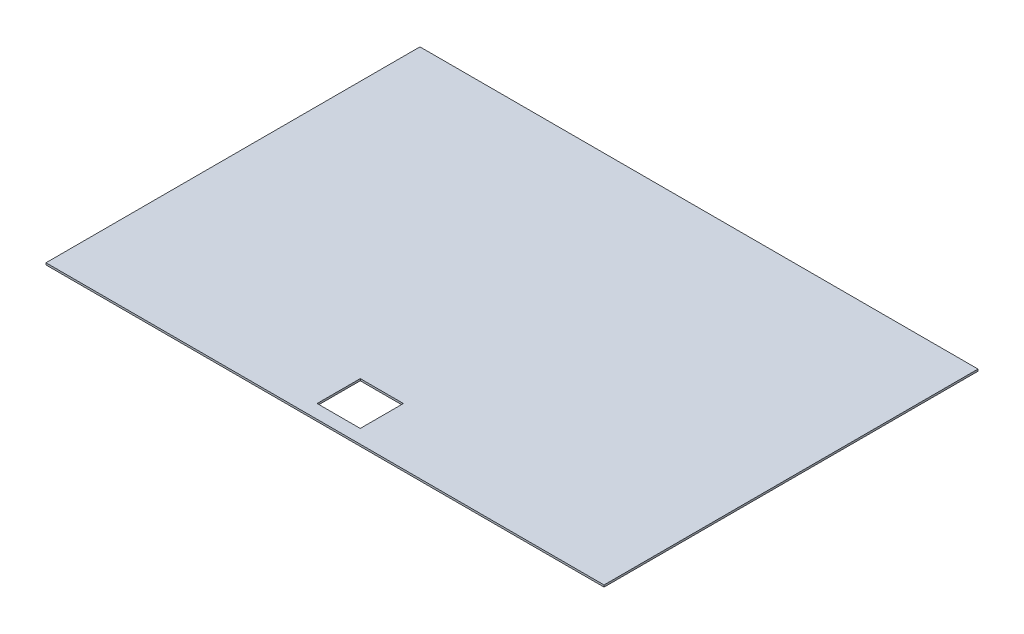
ISO-10303-21;
HEADER;
FILE_DESCRIPTION(('STEP AP214'),'2;1');
FILE_NAME('part.step','',(''),(''),'','','');
FILE_SCHEMA(('AUTOMOTIVE_DESIGN { 1 0 10303 214 1 1 1 1 }'));
ENDSEC;
DATA;
#1=APPLICATION_CONTEXT('core data for automotive mechanical design processes');
#2=APPLICATION_PROTOCOL_DEFINITION('international standard','automotive_design',2000,#1);
#3=PRODUCT_CONTEXT('',#1,'mechanical');
#4=PRODUCT('Part','Part','',(#3));
#5=PRODUCT_RELATED_PRODUCT_CATEGORY('part','',(#4));
#6=PRODUCT_DEFINITION_FORMATION('','',#4);
#7=PRODUCT_DEFINITION_CONTEXT('part definition',#1,'design');
#8=PRODUCT_DEFINITION('design','',#6,#7);
#9=PRODUCT_DEFINITION_SHAPE('','',#8);
#10=(LENGTH_UNIT() NAMED_UNIT(*) SI_UNIT(.MILLI.,.METRE.));
#11=(NAMED_UNIT(*) PLANE_ANGLE_UNIT() SI_UNIT($,.RADIAN.));
#12=(NAMED_UNIT(*) SI_UNIT($,.STERADIAN.) SOLID_ANGLE_UNIT());
#13=UNCERTAINTY_MEASURE_WITH_UNIT(LENGTH_MEASURE(1.E-05),#10,'distance_accuracy_value','');
#14=(GEOMETRIC_REPRESENTATION_CONTEXT(3) GLOBAL_UNCERTAINTY_ASSIGNED_CONTEXT((#13)) GLOBAL_UNIT_ASSIGNED_CONTEXT((#10,
#11,#12)) REPRESENTATION_CONTEXT('',''));
#15=CARTESIAN_POINT('',(0.,0.,0.));
#16=DIRECTION('',(0.,0.,1.));
#17=DIRECTION('',(1.,0.,0.));
#18=AXIS2_PLACEMENT_3D('',#15,#16,#17);
#19=CARTESIAN_POINT('',(0.,3.175,0.));
#20=DIRECTION('',(0.,0.,-1.));
#21=DIRECTION('',(-1.,0.,0.));
#22=AXIS2_PLACEMENT_3D('',#19,#20,#21);
#23=PLANE('',#22);
#24=DIRECTION('',(1.,0.,0.));
#25=VECTOR('',#24,1.);
#26=CARTESIAN_POINT('',(0.,0.,0.));
#27=LINE('',#26,#25);
#28=CARTESIAN_POINT('',(0.,0.,0.));
#29=VERTEX_POINT('',#28);
#30=CARTESIAN_POINT('',(923.925,0.,0.));
#31=VERTEX_POINT('',#30);
#32=EDGE_CURVE('E132',#29,#31,#27,.T.);
#33=ORIENTED_EDGE('',*,*,#32,.T.);
#34=DIRECTION('',(0.,-1.,0.));
#35=VECTOR('',#34,1.);
#36=CARTESIAN_POINT('',(923.925,3.175,0.));
#37=LINE('',#36,#35);
#38=CARTESIAN_POINT('',(923.925,3.175,0.));
#39=VERTEX_POINT('',#38);
#40=EDGE_CURVE('E11',#39,#31,#37,.T.);
#41=ORIENTED_EDGE('',*,*,#40,.F.);
#42=DIRECTION('',(1.,0.,0.));
#43=VECTOR('',#42,1.);
#44=CARTESIAN_POINT('',(0.,3.175,0.));
#45=LINE('',#44,#43);
#46=CARTESIAN_POINT('',(0.,3.175,0.));
#47=VERTEX_POINT('',#46);
#48=EDGE_CURVE('E133',#47,#39,#45,.T.);
#49=ORIENTED_EDGE('',*,*,#48,.F.);
#50=DIRECTION('',(0.,-1.,0.));
#51=VECTOR('',#50,1.);
#52=CARTESIAN_POINT('',(0.,3.175,0.));
#53=LINE('',#52,#51);
#54=EDGE_CURVE('E145',#47,#29,#53,.T.);
#55=ORIENTED_EDGE('',*,*,#54,.T.);
#56=EDGE_LOOP('',(#33,#41,#49,#55));
#57=FACE_BOUND('',#56,.T.);
#58=ADVANCED_FACE('F32',(#57),#23,.F.);
#59=CARTESIAN_POINT('',(923.925,3.175,0.));
#60=DIRECTION('',(-1.,0.,0.));
#61=DIRECTION('',(0.,0.,1.));
#62=AXIS2_PLACEMENT_3D('',#59,#60,#61);
#63=PLANE('',#62);
#64=DIRECTION('',(0.,0.,-1.));
#65=VECTOR('',#64,1.);
#66=CARTESIAN_POINT('',(923.925,0.,0.));
#67=LINE('',#66,#65);
#68=CARTESIAN_POINT('',(923.925,0.,-619.125));
#69=VERTEX_POINT('',#68);
#70=EDGE_CURVE('E148',#31,#69,#67,.T.);
#71=ORIENTED_EDGE('',*,*,#70,.T.);
#72=DIRECTION('',(0.,-1.,0.));
#73=VECTOR('',#72,1.);
#74=CARTESIAN_POINT('',(923.925,3.175,-619.125));
#75=LINE('',#74,#73);
#76=CARTESIAN_POINT('',(923.925,3.175,-619.125));
#77=VERTEX_POINT('',#76);
#78=EDGE_CURVE('E39',#77,#69,#75,.T.);
#79=ORIENTED_EDGE('',*,*,#78,.F.);
#80=DIRECTION('',(0.,0.,-1.));
#81=VECTOR('',#80,1.);
#82=CARTESIAN_POINT('',(923.925,3.175,0.));
#83=LINE('',#82,#81);
#84=EDGE_CURVE('E136',#39,#77,#83,.T.);
#85=ORIENTED_EDGE('',*,*,#84,.F.);
#86=ORIENTED_EDGE('',*,*,#40,.T.);
#87=EDGE_LOOP('',(#71,#79,#85,#86));
#88=FACE_BOUND('',#87,.T.);
#89=ADVANCED_FACE('F164',(#88),#63,.F.);
#90=CARTESIAN_POINT('',(0.,3.175,-619.125));
#91=DIRECTION('',(0.,0.,-1.));
#92=DIRECTION('',(-1.,0.,0.));
#93=AXIS2_PLACEMENT_3D('',#90,#91,#92);
#94=PLANE('',#93);
#95=DIRECTION('',(1.,0.,0.));
#96=VECTOR('',#95,1.);
#97=CARTESIAN_POINT('',(0.,0.,-619.125));
#98=LINE('',#97,#96);
#99=CARTESIAN_POINT('',(0.,0.,-619.125));
#100=VERTEX_POINT('',#99);
#101=EDGE_CURVE('E151',#100,#69,#98,.T.);
#102=ORIENTED_EDGE('',*,*,#101,.F.);
#103=DIRECTION('',(0.,-1.,0.));
#104=VECTOR('',#103,1.);
#105=CARTESIAN_POINT('',(0.,3.175,-619.125));
#106=LINE('',#105,#104);
#107=CARTESIAN_POINT('',(0.,3.175,-619.125));
#108=VERTEX_POINT('',#107);
#109=EDGE_CURVE('E157',#108,#100,#106,.T.);
#110=ORIENTED_EDGE('',*,*,#109,.F.);
#111=DIRECTION('',(1.,0.,0.));
#112=VECTOR('',#111,1.);
#113=CARTESIAN_POINT('',(0.,3.175,-619.125));
#114=LINE('',#113,#112);
#115=EDGE_CURVE('E139',#108,#77,#114,.T.);
#116=ORIENTED_EDGE('',*,*,#115,.T.);
#117=ORIENTED_EDGE('',*,*,#78,.T.);
#118=EDGE_LOOP('',(#102,#110,#116,#117));
#119=FACE_BOUND('',#118,.T.);
#120=ADVANCED_FACE('F161',(#119),#94,.T.);
#121=CARTESIAN_POINT('',(0.,3.175,0.));
#122=DIRECTION('',(-1.,0.,0.));
#123=DIRECTION('',(0.,0.,1.));
#124=AXIS2_PLACEMENT_3D('',#121,#122,#123);
#125=PLANE('',#124);
#126=DIRECTION('',(0.,0.,-1.));
#127=VECTOR('',#126,1.);
#128=CARTESIAN_POINT('',(0.,0.,0.));
#129=LINE('',#128,#127);
#130=EDGE_CURVE('E137',#29,#100,#129,.T.);
#131=ORIENTED_EDGE('',*,*,#130,.F.);
#132=ORIENTED_EDGE('',*,*,#54,.F.);
#133=DIRECTION('',(0.,0.,-1.));
#134=VECTOR('',#133,1.);
#135=CARTESIAN_POINT('',(0.,3.175,0.));
#136=LINE('',#135,#134);
#137=EDGE_CURVE('E142',#47,#108,#136,.T.);
#138=ORIENTED_EDGE('',*,*,#137,.T.);
#139=ORIENTED_EDGE('',*,*,#109,.T.);
#140=EDGE_LOOP('',(#131,#132,#138,#139));
#141=FACE_BOUND('',#140,.T.);
#142=ADVANCED_FACE('F169',(#141),#125,.T.);
#143=CARTESIAN_POINT('',(0.,3.175,0.));
#144=DIRECTION('',(0.,1.,0.));
#145=DIRECTION('',(0.,0.,1.));
#146=AXIS2_PLACEMENT_3D('',#143,#144,#145);
#147=PLANE('',#146);
#148=DIRECTION('',(0.,0.,1.));
#149=VECTOR('',#148,1.);
#150=CARTESIAN_POINT('',(426.24375,3.175,0.));
#151=LINE('',#150,#149);
#152=CARTESIAN_POINT('',(426.24375,3.175,-94.0435));
#153=VERTEX_POINT('',#152);
#154=CARTESIAN_POINT('',(426.24375,3.175,-22.606));
#155=VERTEX_POINT('',#154);
#156=EDGE_CURVE('E102',#153,#155,#151,.T.);
#157=ORIENTED_EDGE('',*,*,#156,.F.);
#158=DIRECTION('',(-1.,0.,0.));
#159=VECTOR('',#158,1.);
#160=CARTESIAN_POINT('',(0.,3.175,-94.0435));
#161=LINE('',#160,#159);
#162=CARTESIAN_POINT('',(497.68125,3.175,-94.0435));
#163=VERTEX_POINT('',#162);
#164=EDGE_CURVE('E129',#163,#153,#161,.T.);
#165=ORIENTED_EDGE('',*,*,#164,.F.);
#166=DIRECTION('',(0.,0.,-1.));
#167=VECTOR('',#166,1.);
#168=CARTESIAN_POINT('',(497.68125,3.175,0.));
#169=LINE('',#168,#167);
#170=CARTESIAN_POINT('',(497.68125,3.175,-22.606));
#171=VERTEX_POINT('',#170);
#172=EDGE_CURVE('E127',#171,#163,#169,.T.);
#173=ORIENTED_EDGE('',*,*,#172,.F.);
#174=DIRECTION('',(1.,0.,0.));
#175=VECTOR('',#174,1.);
#176=CARTESIAN_POINT('',(0.,3.175,-22.606));
#177=LINE('',#176,#175);
#178=EDGE_CURVE('E121',#155,#171,#177,.T.);
#179=ORIENTED_EDGE('',*,*,#178,.F.);
#180=EDGE_LOOP('',(#157,#165,#173,#179));
#181=FACE_BOUND('',#180,.T.);
#182=ORIENTED_EDGE('',*,*,#48,.T.);
#183=ORIENTED_EDGE('',*,*,#84,.T.);
#184=ORIENTED_EDGE('',*,*,#115,.F.);
#185=ORIENTED_EDGE('',*,*,#137,.F.);
#186=EDGE_LOOP('',(#182,#183,#184,#185));
#187=FACE_BOUND('',#186,.T.);
#188=ADVANCED_FACE('F173',(#181,#187),#147,.T.);
#189=CARTESIAN_POINT('',(0.,0.,0.));
#190=DIRECTION('',(0.,1.,0.));
#191=DIRECTION('',(0.,0.,1.));
#192=AXIS2_PLACEMENT_3D('',#189,#190,#191);
#193=PLANE('',#192);
#194=DIRECTION('',(-1.,0.,0.));
#195=VECTOR('',#194,1.);
#196=CARTESIAN_POINT('',(426.24375,0.,-94.0435));
#197=LINE('',#196,#195);
#198=CARTESIAN_POINT('',(497.68125,0.,-94.0435));
#199=VERTEX_POINT('',#198);
#200=CARTESIAN_POINT('',(426.24375,0.,-94.0435));
#201=VERTEX_POINT('',#200);
#202=EDGE_CURVE('E105',#199,#201,#197,.T.);
#203=ORIENTED_EDGE('',*,*,#202,.T.);
#204=DIRECTION('',(0.,0.,1.));
#205=VECTOR('',#204,1.);
#206=CARTESIAN_POINT('',(426.24375,0.,-22.606));
#207=LINE('',#206,#205);
#208=CARTESIAN_POINT('',(426.24375,0.,-22.606));
#209=VERTEX_POINT('',#208);
#210=EDGE_CURVE('E99',#201,#209,#207,.T.);
#211=ORIENTED_EDGE('',*,*,#210,.T.);
#212=DIRECTION('',(1.,0.,0.));
#213=VECTOR('',#212,1.);
#214=CARTESIAN_POINT('',(426.24375,0.,-22.606));
#215=LINE('',#214,#213);
#216=CARTESIAN_POINT('',(497.68125,0.,-22.606));
#217=VERTEX_POINT('',#216);
#218=EDGE_CURVE('E108',#209,#217,#215,.T.);
#219=ORIENTED_EDGE('',*,*,#218,.T.);
#220=DIRECTION('',(0.,0.,-1.));
#221=VECTOR('',#220,1.);
#222=CARTESIAN_POINT('',(497.68125,0.,-22.606));
#223=LINE('',#222,#221);
#224=EDGE_CURVE('E54',#217,#199,#223,.T.);
#225=ORIENTED_EDGE('',*,*,#224,.T.);
#226=EDGE_LOOP('',(#203,#211,#219,#225));
#227=FACE_BOUND('',#226,.T.);
#228=ORIENTED_EDGE('',*,*,#32,.F.);
#229=ORIENTED_EDGE('',*,*,#130,.T.);
#230=ORIENTED_EDGE('',*,*,#101,.T.);
#231=ORIENTED_EDGE('',*,*,#70,.F.);
#232=EDGE_LOOP('',(#228,#229,#230,#231));
#233=FACE_BOUND('',#232,.T.);
#234=ADVANCED_FACE('F112',(#227,#233),#193,.F.);
#235=CARTESIAN_POINT('',(426.24375,0.,-22.606));
#236=DIRECTION('',(-1.,0.,0.));
#237=DIRECTION('',(0.,0.,1.));
#238=AXIS2_PLACEMENT_3D('',#235,#236,#237);
#239=PLANE('',#238);
#240=ORIENTED_EDGE('',*,*,#156,.T.);
#241=DIRECTION('',(0.,1.,0.));
#242=VECTOR('',#241,1.);
#243=CARTESIAN_POINT('',(426.24375,0.,-22.606));
#244=LINE('',#243,#242);
#245=EDGE_CURVE('E46',#209,#155,#244,.T.);
#246=ORIENTED_EDGE('',*,*,#245,.F.);
#247=ORIENTED_EDGE('',*,*,#210,.F.);
#248=DIRECTION('',(0.,1.,0.));
#249=VECTOR('',#248,1.);
#250=CARTESIAN_POINT('',(426.24375,0.,-94.0435));
#251=LINE('',#250,#249);
#252=EDGE_CURVE('E119',#201,#153,#251,.T.);
#253=ORIENTED_EDGE('',*,*,#252,.T.);
#254=EDGE_LOOP('',(#240,#246,#247,#253));
#255=FACE_BOUND('',#254,.T.);
#256=ADVANCED_FACE('F96',(#255),#239,.F.);
#257=CARTESIAN_POINT('',(426.24375,0.,-94.0435));
#258=DIRECTION('',(0.,0.,-1.));
#259=DIRECTION('',(-1.,0.,0.));
#260=AXIS2_PLACEMENT_3D('',#257,#258,#259);
#261=PLANE('',#260);
#262=ORIENTED_EDGE('',*,*,#164,.T.);
#263=ORIENTED_EDGE('',*,*,#252,.F.);
#264=ORIENTED_EDGE('',*,*,#202,.F.);
#265=DIRECTION('',(0.,1.,0.));
#266=VECTOR('',#265,1.);
#267=CARTESIAN_POINT('',(497.68125,0.,-94.0435));
#268=LINE('',#267,#266);
#269=EDGE_CURVE('E122',#199,#163,#268,.T.);
#270=ORIENTED_EDGE('',*,*,#269,.T.);
#271=EDGE_LOOP('',(#262,#263,#264,#270));
#272=FACE_BOUND('',#271,.T.);
#273=ADVANCED_FACE('F193',(#272),#261,.F.);
#274=CARTESIAN_POINT('',(497.68125,0.,-22.606));
#275=DIRECTION('',(1.,0.,0.));
#276=DIRECTION('',(0.,0.,-1.));
#277=AXIS2_PLACEMENT_3D('',#274,#275,#276);
#278=PLANE('',#277);
#279=ORIENTED_EDGE('',*,*,#172,.T.);
#280=ORIENTED_EDGE('',*,*,#269,.F.);
#281=ORIENTED_EDGE('',*,*,#224,.F.);
#282=DIRECTION('',(0.,1.,0.));
#283=VECTOR('',#282,1.);
#284=CARTESIAN_POINT('',(497.68125,0.,-22.606));
#285=LINE('',#284,#283);
#286=EDGE_CURVE('E104',#217,#171,#285,.T.);
#287=ORIENTED_EDGE('',*,*,#286,.T.);
#288=EDGE_LOOP('',(#279,#280,#281,#287));
#289=FACE_BOUND('',#288,.T.);
#290=ADVANCED_FACE('F196',(#289),#278,.F.);
#291=CARTESIAN_POINT('',(426.24375,0.,-22.606));
#292=DIRECTION('',(0.,0.,1.));
#293=DIRECTION('',(1.,0.,0.));
#294=AXIS2_PLACEMENT_3D('',#291,#292,#293);
#295=PLANE('',#294);
#296=ORIENTED_EDGE('',*,*,#178,.T.);
#297=ORIENTED_EDGE('',*,*,#286,.F.);
#298=ORIENTED_EDGE('',*,*,#218,.F.);
#299=ORIENTED_EDGE('',*,*,#245,.T.);
#300=EDGE_LOOP('',(#296,#297,#298,#299));
#301=FACE_BOUND('',#300,.T.);
#302=ADVANCED_FACE('F109',(#301),#295,.F.);
#303=CLOSED_SHELL('',(#58,#89,#120,#142,#188,#234,#256,#273,#290,#302));
#304=MANIFOLD_SOLID_BREP('B2',#303);
#305=ADVANCED_BREP_SHAPE_REPRESENTATION('',(#18,#304),#14);
#306=SHAPE_DEFINITION_REPRESENTATION(#9,#305);
ENDSEC;
END-ISO-10303-21;
